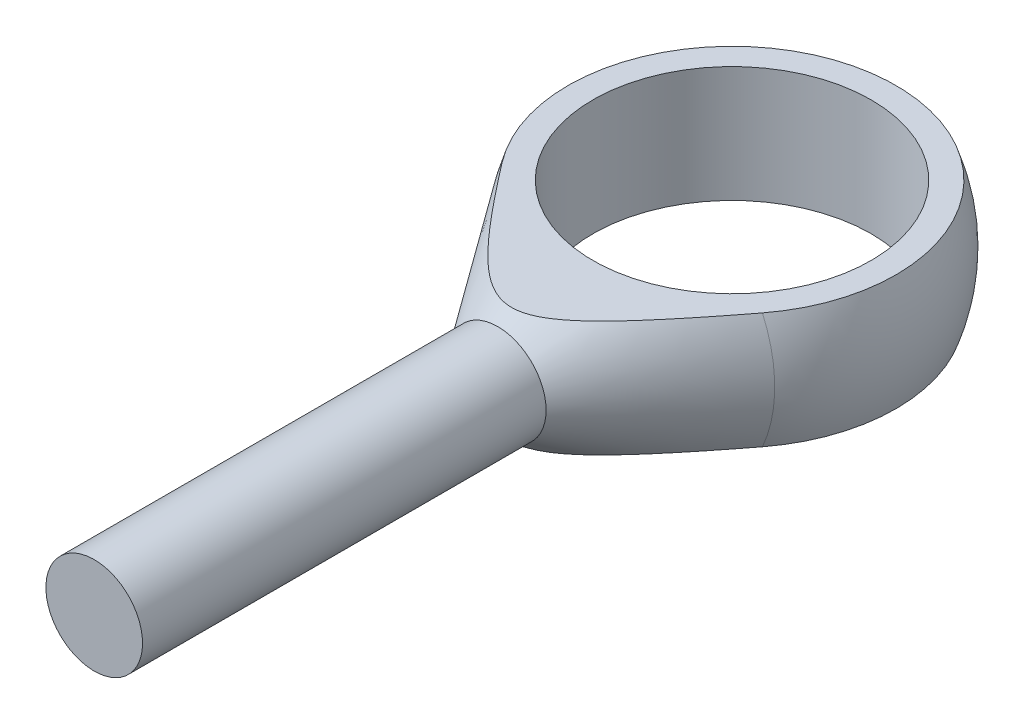
ISO-10303-21;
HEADER;
FILE_DESCRIPTION(('STEP AP214'),'2;1');
FILE_NAME('part.step','',(''),(''),'','','');
FILE_SCHEMA(('AUTOMOTIVE_DESIGN { 1 0 10303 214 1 1 1 1 }'));
ENDSEC;
DATA;
#1=APPLICATION_CONTEXT('core data for automotive mechanical design processes');
#2=APPLICATION_PROTOCOL_DEFINITION('international standard','automotive_design',2000,#1);
#3=PRODUCT_CONTEXT('',#1,'mechanical');
#4=PRODUCT('Part','Part','',(#3));
#5=PRODUCT_RELATED_PRODUCT_CATEGORY('part','',(#4));
#6=PRODUCT_DEFINITION_FORMATION('','',#4);
#7=PRODUCT_DEFINITION_CONTEXT('part definition',#1,'design');
#8=PRODUCT_DEFINITION('design','',#6,#7);
#9=PRODUCT_DEFINITION_SHAPE('','',#8);
#10=(LENGTH_UNIT() NAMED_UNIT(*) SI_UNIT(.MILLI.,.METRE.));
#11=(NAMED_UNIT(*) PLANE_ANGLE_UNIT() SI_UNIT($,.RADIAN.));
#12=(NAMED_UNIT(*) SI_UNIT($,.STERADIAN.) SOLID_ANGLE_UNIT());
#13=UNCERTAINTY_MEASURE_WITH_UNIT(LENGTH_MEASURE(1.E-05),#10,'distance_accuracy_value','');
#14=(GEOMETRIC_REPRESENTATION_CONTEXT(3) GLOBAL_UNCERTAINTY_ASSIGNED_CONTEXT((#13)) GLOBAL_UNIT_ASSIGNED_CONTEXT((#10,
#11,#12)) REPRESENTATION_CONTEXT('',''));
#15=CARTESIAN_POINT('',(0.,0.,0.));
#16=DIRECTION('',(0.,0.,1.));
#17=DIRECTION('',(1.,0.,0.));
#18=AXIS2_PLACEMENT_3D('',#15,#16,#17);
#19=CARTESIAN_POINT('',(0.,0.,0.));
#20=DIRECTION('',(0.,-1.,0.));
#21=DIRECTION('',(-1.,0.,0.));
#22=AXIS2_PLACEMENT_3D('',#19,#20,#21);
#23=SPHERICAL_SURFACE('',#22,9.);
#24=CARTESIAN_POINT('',(0.,3.,0.));
#25=DIRECTION('',(0.,-1.,0.));
#26=DIRECTION('',(0.,0.,-1.));
#27=AXIS2_PLACEMENT_3D('',#24,#25,#26);
#28=CIRCLE('',#27,8.48528137423857);
#29=CARTESIAN_POINT('',(-6.73437568039459,2.99999999999998,5.16218792715937));
#30=VERTEX_POINT('',#29);
#31=CARTESIAN_POINT('',(6.73437568039457,3.00000000000002,5.16218792715937));
#32=VERTEX_POINT('',#31);
#33=EDGE_CURVE('E58',#30,#32,#28,.T.);
#34=ORIENTED_EDGE('',*,*,#33,.T.);
#35=CARTESIAN_POINT('',(0.,0.,5.16218792715937));
#36=DIRECTION('',(0.,0.,-1.));
#37=DIRECTION('',(-1.,0.,0.));
#38=AXIS2_PLACEMENT_3D('',#35,#36,#37);
#39=CIRCLE('',#38,7.37236839860095);
#40=CARTESIAN_POINT('',(6.73437568039459,-2.99999999999998,5.16218792715937));
#41=VERTEX_POINT('',#40);
#42=EDGE_CURVE('E74',#32,#41,#39,.T.);
#43=ORIENTED_EDGE('',*,*,#42,.T.);
#44=CARTESIAN_POINT('',(0.,-3.,0.));
#45=DIRECTION('',(0.,-1.,0.));
#46=DIRECTION('',(0.,0.,-1.));
#47=AXIS2_PLACEMENT_3D('',#44,#45,#46);
#48=CIRCLE('',#47,8.48528137423857);
#49=CARTESIAN_POINT('',(-6.73437568039457,-3.00000000000002,5.16218792715937));
#50=VERTEX_POINT('',#49);
#51=EDGE_CURVE('E69',#50,#41,#48,.T.);
#52=ORIENTED_EDGE('',*,*,#51,.F.);
#53=EDGE_CURVE('E72',#50,#30,#39,.T.);
#54=ORIENTED_EDGE('',*,*,#53,.T.);
#55=EDGE_LOOP('',(#34,#43,#52,#54));
#56=FACE_BOUND('',#55,.T.);
#57=ADVANCED_FACE('F39',(#56),#23,.T.);
#58=CARTESIAN_POINT('',(-7.2,-3.,0.));
#59=DIRECTION('',(0.,1.,0.));
#60=DIRECTION('',(0.,0.,1.));
#61=AXIS2_PLACEMENT_3D('',#58,#59,#60);
#62=PLANE('',#61);
#63=CARTESIAN_POINT('',(18.3408361734717,-2.99999999999994,-10.8504965729031));
#64=CARTESIAN_POINT('',(17.8496953666628,-2.99999999999994,-10.158304125032));
#65=CARTESIAN_POINT('',(17.3582394375304,-2.99999999999994,-9.46633474897407));
#66=CARTESIAN_POINT('',(16.3744051269048,-2.99999999999994,-8.0829688508108));
#67=CARTESIAN_POINT('',(15.8820266748044,-2.99999999999994,-7.3915723789271));
#68=CARTESIAN_POINT('',(14.8943611292801,-2.99999999999995,-6.00710521762286));
#69=CARTESIAN_POINT('',(14.3990699431728,-2.99999999999995,-5.3140374469505));
#70=CARTESIAN_POINT('',(13.4069826200578,-2.99999999999995,-3.92905967868847));
#71=CARTESIAN_POINT('',(12.9101866016022,-2.99999999999996,-3.23714959623604));
#72=CARTESIAN_POINT('',(12.0848309166761,-2.99999999999996,-2.09141471926));
#73=CARTESIAN_POINT('',(11.7568826860212,-2.99999999999996,-1.63714955383807));
#74=CARTESIAN_POINT('',(11.0997953370015,-2.99999999999996,-0.729481526529152));
#75=CARTESIAN_POINT('',(10.7706562197244,-2.99999999999996,-0.276078663855275));
#76=CARTESIAN_POINT('',(10.1107447600538,-2.99999999999996,0.629722811027464));
#77=CARTESIAN_POINT('',(9.77997200525646,-2.99999999999997,1.08212112295249));
#78=CARTESIAN_POINT('',(9.11637520329296,-2.99999999999997,1.98539896257034));
#79=CARTESIAN_POINT('',(8.78355119633724,-2.99999999999997,2.43627851976883));
#80=CARTESIAN_POINT('',(8.1161522031276,-2.99999999999997,3.33448751664643));
#81=CARTESIAN_POINT('',(7.78158632111017,-2.99999999999997,3.78182371532488));
#82=CARTESIAN_POINT('',(7.1084400604982,-2.99999999999998,4.67353250223299));
#83=CARTESIAN_POINT('',(6.76985936622562,-2.99999999999998,5.11790485307009));
#84=CARTESIAN_POINT('',(6.25755917386607,-2.99999999999998,5.78087713429529));
#85=CARTESIAN_POINT('',(6.08609497474082,-2.99999999999998,6.00121894179376));
#86=CARTESIAN_POINT('',(5.74126694261255,-2.99999999999998,6.44040975091969));
#87=CARTESIAN_POINT('',(5.5679031309455,-2.99999999999998,6.65925876926909));
#88=CARTESIAN_POINT('',(5.21877706533775,-2.99999999999998,7.09498952327412));
#89=CARTESIAN_POINT('',(5.0430151361045,-2.99999999999998,7.31187151877469));
#90=CARTESIAN_POINT('',(4.68834152429886,-2.99999999999998,7.7430407185915));
#91=CARTESIAN_POINT('',(4.50942998376244,-2.99999999999998,7.95732803918628));
#92=CARTESIAN_POINT('',(4.26911739167486,-2.99999999999999,8.23939493538093));
#93=CARTESIAN_POINT('',(4.20960625784181,-2.99999999999999,8.30878604969739));
#94=CARTESIAN_POINT('',(4.09007560383522,-2.99999999999999,8.44712969375365));
#95=CARTESIAN_POINT('',(4.03005608047228,-2.99999999999999,8.5160822207372));
#96=CARTESIAN_POINT('',(3.84914339184583,-2.99999999999999,8.72221433728284));
#97=CARTESIAN_POINT('',(3.72740627554525,-2.99999999999999,8.85865648841562));
#98=CARTESIAN_POINT('',(3.48055556744023,-2.99999999999999,9.12961765402039));
#99=CARTESIAN_POINT('',(3.35542894986392,-2.99999999999999,9.26412483613365));
#100=CARTESIAN_POINT('',(3.10159711198437,-2.99999999999999,9.52968710634544));
#101=CARTESIAN_POINT('',(2.97289260740304,-2.99999999999999,9.66074287479596));
#102=CARTESIAN_POINT('',(2.71542360341994,-2.99999999999999,9.91362158788298));
#103=CARTESIAN_POINT('',(2.58681973143847,-2.99999999999999,10.0356071424581));
#104=CARTESIAN_POINT('',(2.32382986754002,-2.99999999999999,10.2734998512875));
#105=CARTESIAN_POINT('',(2.18943878741538,-2.99999999999999,10.3894014492556));
#106=CARTESIAN_POINT('',(1.91420118797999,-2.99999999999999,10.6112856680158));
#107=CARTESIAN_POINT('',(1.77340711928382,-2.99999999999999,10.7173327149079));
#108=CARTESIAN_POINT('',(1.48244491888888,-2.99999999999999,10.9155126535024));
#109=CARTESIAN_POINT('',(1.33229917814859,-3.,11.0076771017169));
#110=CARTESIAN_POINT('',(1.11478621695225,-3.,11.121063039446));
#111=CARTESIAN_POINT('',(1.05221883665336,-3.,11.151501792557));
#112=CARTESIAN_POINT('',(0.925205033640339,-3.,11.2082834384152));
#113=CARTESIAN_POINT('',(0.860757915306809,-3.,11.2346247914354));
#114=CARTESIAN_POINT('',(0.730293128741352,-3.,11.2823743182219));
#115=CARTESIAN_POINT('',(0.664281536403156,-3.,11.3037989390249));
#116=CARTESIAN_POINT('',(0.530687488679508,-3.,11.3410641659255));
#117=CARTESIAN_POINT('',(0.463105146508561,-3.,11.3569051731494));
#118=CARTESIAN_POINT('',(0.325826454633525,-3.,11.3824917991943));
#119=CARTESIAN_POINT('',(0.256113848719209,-3.,11.3921514542846));
#120=CARTESIAN_POINT('',(0.116074538359548,-3.,11.4045325674609));
#121=CARTESIAN_POINT('',(0.0457479058310169,-3.,11.4072548274232));
#122=CARTESIAN_POINT('',(-0.0949458205595684,-3.,11.4056113983568));
#123=CARTESIAN_POINT('',(-0.165312767512023,-3.,11.4012332165897));
#124=CARTESIAN_POINT('',(-0.305277921977597,-3.,11.3856055251109));
#125=CARTESIAN_POINT('',(-0.374875998538595,-3.,11.3743548627188));
#126=CARTESIAN_POINT('',(-0.520804237702084,-3.,11.3438561717914));
#127=CARTESIAN_POINT('',(-0.596969822226068,-3.,11.3238267403435));
#128=CARTESIAN_POINT('',(-0.747176407964006,-3.,11.276936685599));
#129=CARTESIAN_POINT('',(-0.821216285776014,-3.,11.2500725216067));
#130=CARTESIAN_POINT('',(-0.967069499237322,-3.,11.1905809102426));
#131=CARTESIAN_POINT('',(-1.03887867457237,-3.,11.1579433747816));
#132=CARTESIAN_POINT('',(-1.18013585332305,-3.,11.0879664093157));
#133=CARTESIAN_POINT('',(-1.24958405409333,-3.,11.050627373544));
#134=CARTESIAN_POINT('',(-1.41112036140978,-3.00000000000001,10.9578424324715));
#135=CARTESIAN_POINT('',(-1.50225870487227,-3.00000000000001,10.9007493518333));
#136=CARTESIAN_POINT('',(-1.68093684285748,-3.00000000000001,10.7811571723269));
#137=CARTESIAN_POINT('',(-1.76847472117177,-3.00000000000001,10.7186552483579));
#138=CARTESIAN_POINT('',(-1.94059475835379,-3.00000000000001,10.5894051099494));
#139=CARTESIAN_POINT('',(-2.02517105182977,-3.00000000000001,10.5226491343123));
#140=CARTESIAN_POINT('',(-2.19167985251268,-3.00000000000001,10.3859130808501));
#141=CARTESIAN_POINT('',(-2.27361198733039,-3.00000000000001,10.3159325522364));
#142=CARTESIAN_POINT('',(-2.43584604807881,-3.00000000000001,10.1728885170448));
#143=CARTESIAN_POINT('',(-2.51613073934952,-3.00000000000001,10.099805542985));
#144=CARTESIAN_POINT('',(-2.67476833257466,-3.00000000000001,9.95157355529744));
#145=CARTESIAN_POINT('',(-2.75312116538855,-3.00000000000001,9.87642446792735));
#146=CARTESIAN_POINT('',(-2.90808025588691,-3.00000000000001,9.72454789539904));
#147=CARTESIAN_POINT('',(-2.98468863084358,-3.00000000000001,9.64782256520879));
#148=CARTESIAN_POINT('',(-3.13649231317561,-3.00000000000001,9.49299541468063));
#149=CARTESIAN_POINT('',(-3.21168767165691,-3.00000000000001,9.41489364432452));
#150=CARTESIAN_POINT('',(-3.45558111649027,-3.00000000000001,9.15766239337677));
#151=CARTESIAN_POINT('',(-3.62178024495769,-3.00000000000001,8.97616294665082));
#152=CARTESIAN_POINT('',(-3.94967580622338,-3.00000000000001,8.60913089694175));
#153=CARTESIAN_POINT('',(-4.11137162227899,-3.00000000000001,8.4235977476659));
#154=CARTESIAN_POINT('',(-4.43142518656328,-3.00000000000002,8.04955221619529));
#155=CARTESIAN_POINT('',(-4.58978157368969,-3.00000000000002,7.86103867198956));
#156=CARTESIAN_POINT('',(-4.90387830965965,-3.00000000000002,7.48184107780178));
#157=CARTESIAN_POINT('',(-5.05961857770351,-3.00000000000002,7.29115696108492));
#158=CARTESIAN_POINT('',(-5.36929440882113,-3.00000000000002,6.9078119906199));
#159=CARTESIAN_POINT('',(-5.5232265759225,-3.00000000000002,6.71514839776191));
#160=CARTESIAN_POINT('',(-5.82943566648462,-3.00000000000002,6.32850920916978));
#161=CARTESIAN_POINT('',(-5.98171257391047,-3.00000000000002,6.13453360075532));
#162=CARTESIAN_POINT('',(-6.43646561025439,-3.00000000000002,5.55114684840522));
#163=CARTESIAN_POINT('',(-6.73694252684683,-3.00000000000002,5.16017790377202));
#164=CARTESIAN_POINT('',(-7.33295840808353,-3.00000000000003,4.37716949487784));
#165=CARTESIAN_POINT('',(-7.62851310088097,-3.00000000000003,3.98514195894165));
#166=CARTESIAN_POINT('',(-8.2170321201009,-3.00000000000003,3.19911207244249));
#167=CARTESIAN_POINT('',(-8.50999628881428,-3.00000000000003,2.80510960390409));
#168=CARTESIAN_POINT('',(-9.09373307394777,-3.00000000000003,2.01601787210606));
#169=CARTESIAN_POINT('',(-9.384507379181,-3.00000000000003,1.62092985669971));
#170=CARTESIAN_POINT('',(-9.96457854136935,-3.00000000000003,0.82967033536277));
#171=CARTESIAN_POINT('',(-10.2538753957912,-3.00000000000004,0.43349882757623));
#172=CARTESIAN_POINT('',(-10.8707002807484,-3.00000000000004,-0.413781171632223));
#173=CARTESIAN_POINT('',(-11.1980603570777,-3.00000000000004,-0.865011881303814));
#174=CARTESIAN_POINT('',(-11.8516302693239,-3.00000000000004,-1.76830861410294));
#175=CARTESIAN_POINT('',(-12.1778400993516,-3.00000000000004,-2.2203746414893));
#176=CARTESIAN_POINT('',(-13.1553137588347,-3.00000000000005,-3.5778118744112));
#177=CARTESIAN_POINT('',(-13.8052276801744,-3.00000000000005,-4.48415495867676));
#178=CARTESIAN_POINT('',(-15.1037749725347,-3.00000000000005,-6.29998894752358));
#179=CARTESIAN_POINT('',(-15.7524045318709,-3.00000000000006,-7.20948257485395));
#180=CARTESIAN_POINT('',(-16.7240226372889,-3.00000000000006,-8.57445198594485));
#181=CARTESIAN_POINT('',(-17.0476237053124,-3.00000000000006,-9.02949193634293));
#182=CARTESIAN_POINT('',(-17.6944768154627,-3.00000000000006,-9.93981923128047));
#183=CARTESIAN_POINT('',(-18.0177288579079,-3.00000000000006,-10.3951065755937));
#184=CARTESIAN_POINT('',(-18.3408361734716,-3.00000000000006,-10.8504965729031));
#185=B_SPLINE_CURVE_WITH_KNOTS('',3,(#63,#64,#65,#66,#67,#68,#69,#70,#71,#72,#73,#74,#75,#76,
#77,#78,#79,#80,#81,#82,#83,#84,#85,#86,#87,#88,#89,#90,#91,#92,#93,#94,#95,#96,#97,#98,#99,
#100,#101,#102,#103,#104,#105,#106,#107,#108,#109,#110,#111,#112,#113,#114,#115,#116,#117,#118,
#119,#120,#121,#122,#123,#124,#125,#126,#127,#128,#129,#130,#131,#132,#133,#134,#135,#136,#137,
#138,#139,#140,#141,#142,#143,#144,#145,#146,#147,#148,#149,#150,#151,#152,#153,#154,#155,#156,
#157,#158,#159,#160,#161,#162,#163,#164,#165,#166,#167,#168,#169,#170,#171,#172,#173,#174,#175,
#176,#177,#178,#179,#180,#181,#182,#183,#184),.UNSPECIFIED.,.F.,.F.,(4,2,2,2,2,2,2,2,2,2,2,2,2,
2,2,2,2,2,2,2,2,2,2,2,2,2,2,2,2,2,2,2,2,2,2,2,2,2,2,2,2,2,2,2,2,2,2,2,2,2,2,2,2,2,2,2,2,2,2,2,
4),(0.,2.54620304839511,5.09260966146757,7.64817210059546,10.203538190685,11.8843585748652,
13.5651774244979,15.246444818539,16.9276793590942,18.6034937513821,20.2794407956318,
21.1170216200283,21.9545930465517,22.7920521688657,23.6294736210876,23.9037165021729,
24.1779611050063,24.7264974310509,25.2775740550703,25.8285412237044,26.3601720882286,
26.8922803161484,27.4206206089614,27.9477411956251,28.1563607120305,28.3650584353659,
28.5730475200073,28.7810216596831,28.9918285971807,29.2026111669256,29.4137649965893,
29.6249542515586,29.8608416827388,30.0968515638129,30.3332779849157,30.5696845942183,
30.8920506508579,31.2145861111306,31.5377278639674,31.86091492951,32.1865708659254,
32.5122384405831,32.8374870473452,33.1627238677966,33.9008940862379,34.6391649071613,
35.3777310372224,36.1163199363525,36.8561256613144,37.5959385465782,39.0751880086817,
40.5480446989135,42.0209904465883,43.4926513080847,44.9643146920321,46.6367249045641,
48.3091436674435,51.6549720954198,55.0062518917388,56.6813669904899,58.3564805600206),.UNSPECIFIED.);
#186=EDGE_CURVE('E53',#41,#50,#185,.T.);
#187=ORIENTED_EDGE('',*,*,#186,.T.);
#188=ORIENTED_EDGE('',*,*,#51,.T.);
#189=EDGE_LOOP('',(#187,#188));
#190=FACE_BOUND('',#189,.T.);
#191=CARTESIAN_POINT('',(0.,-3.,0.));
#192=DIRECTION('',(0.,-1.,0.));
#193=DIRECTION('',(0.,0.,-1.));
#194=AXIS2_PLACEMENT_3D('',#191,#192,#193);
#195=CIRCLE('',#194,7.2);
#196=CARTESIAN_POINT('',(0.,-3.,-7.2));
#197=VERTEX_POINT('',#196);
#198=EDGE_CURVE('E79',#197,#197,#195,.T.);
#199=ORIENTED_EDGE('',*,*,#198,.F.);
#200=EDGE_LOOP('',(#199));
#201=FACE_BOUND('',#200,.T.);
#202=ADVANCED_FACE('F81',(#190,#201),#62,.F.);
#203=CARTESIAN_POINT('',(0.,-4.38771613082962,0.));
#204=DIRECTION('',(0.,-1.,0.));
#205=DIRECTION('',(0.,0.,-1.));
#206=AXIS2_PLACEMENT_3D('',#203,#204,#205);
#207=CYLINDRICAL_SURFACE('',#206,7.2);
#208=CARTESIAN_POINT('',(0.,3.,0.));
#209=DIRECTION('',(0.,-1.,0.));
#210=DIRECTION('',(0.,0.,-1.));
#211=AXIS2_PLACEMENT_3D('',#208,#209,#210);
#212=CIRCLE('',#211,7.2);
#213=CARTESIAN_POINT('',(0.,3.,-7.2));
#214=VERTEX_POINT('',#213);
#215=EDGE_CURVE('E96',#214,#214,#212,.T.);
#216=ORIENTED_EDGE('',*,*,#215,.F.);
#217=EDGE_LOOP('',(#216));
#218=FACE_BOUND('',#217,.T.);
#219=ORIENTED_EDGE('',*,*,#198,.T.);
#220=EDGE_LOOP('',(#219));
#221=FACE_BOUND('',#220,.T.);
#222=ADVANCED_FACE('F128',(#218,#221),#207,.F.);
#223=CARTESIAN_POINT('',(-8.48528137423857,3.,0.));
#224=DIRECTION('',(0.,-1.,0.));
#225=DIRECTION('',(0.,0.,-1.));
#226=AXIS2_PLACEMENT_3D('',#223,#224,#225);
#227=PLANE('',#226);
#228=CARTESIAN_POINT('',(-18.3408361734717,2.99999999999994,-10.8504965729031));
#229=CARTESIAN_POINT('',(-17.8496953666628,2.99999999999994,-10.158304125032));
#230=CARTESIAN_POINT('',(-17.3582394375304,2.99999999999994,-9.46633474897408));
#231=CARTESIAN_POINT('',(-16.3744051269048,2.99999999999994,-8.08296885081081));
#232=CARTESIAN_POINT('',(-15.8820266748044,2.99999999999994,-7.39157237892711));
#233=CARTESIAN_POINT('',(-14.8943611292801,2.99999999999995,-6.00710521762287));
#234=CARTESIAN_POINT('',(-14.3990699431729,2.99999999999995,-5.3140374469505));
#235=CARTESIAN_POINT('',(-13.4069826200578,2.99999999999995,-3.92905967868848));
#236=CARTESIAN_POINT('',(-12.9101866016022,2.99999999999996,-3.23714959623605));
#237=CARTESIAN_POINT('',(-12.0848309166761,2.99999999999996,-2.09141471926001));
#238=CARTESIAN_POINT('',(-11.7568826860212,2.99999999999996,-1.63714955383808));
#239=CARTESIAN_POINT('',(-11.0997953370015,2.99999999999996,-0.729481526529162));
#240=CARTESIAN_POINT('',(-10.7706562197244,2.99999999999996,-0.276078663855285));
#241=CARTESIAN_POINT('',(-10.1107447600538,2.99999999999996,0.629722811027455));
#242=CARTESIAN_POINT('',(-9.77997200525647,2.99999999999997,1.08212112295248));
#243=CARTESIAN_POINT('',(-9.11637520329297,2.99999999999997,1.98539896257033));
#244=CARTESIAN_POINT('',(-8.78355119633725,2.99999999999997,2.43627851976882));
#245=CARTESIAN_POINT('',(-8.1161522031276,2.99999999999997,3.33448751664643));
#246=CARTESIAN_POINT('',(-7.78158632111017,2.99999999999997,3.78182371532487));
#247=CARTESIAN_POINT('',(-7.1084400604982,2.99999999999998,4.67353250223299));
#248=CARTESIAN_POINT('',(-6.76985936622562,2.99999999999998,5.11790485307009));
#249=CARTESIAN_POINT('',(-6.25755917386608,2.99999999999998,5.78087713429528));
#250=CARTESIAN_POINT('',(-6.08609497474082,2.99999999999998,6.00121894179375));
#251=CARTESIAN_POINT('',(-5.74126694261255,2.99999999999998,6.44040975091969));
#252=CARTESIAN_POINT('',(-5.5679031309455,2.99999999999998,6.65925876926908));
#253=CARTESIAN_POINT('',(-5.21877706533775,2.99999999999998,7.09498952327412));
#254=CARTESIAN_POINT('',(-5.0430151361045,2.99999999999998,7.31187151877469));
#255=CARTESIAN_POINT('',(-4.68834152429886,2.99999999999998,7.7430407185915));
#256=CARTESIAN_POINT('',(-4.50942998376244,2.99999999999998,7.95732803918628));
#257=CARTESIAN_POINT('',(-4.26911739167486,2.99999999999998,8.23939493538093));
#258=CARTESIAN_POINT('',(-4.20960625784181,2.99999999999998,8.30878604969739));
#259=CARTESIAN_POINT('',(-4.09007560383522,2.99999999999999,8.44712969375365));
#260=CARTESIAN_POINT('',(-4.03005608047228,2.99999999999999,8.51608222073721));
#261=CARTESIAN_POINT('',(-3.84914339184583,2.99999999999999,8.72221433728284));
#262=CARTESIAN_POINT('',(-3.72740627554525,2.99999999999999,8.85865648841563));
#263=CARTESIAN_POINT('',(-3.48055556744023,2.99999999999999,9.12961765402039));
#264=CARTESIAN_POINT('',(-3.35542894986392,2.99999999999999,9.26412483613365));
#265=CARTESIAN_POINT('',(-3.10159711198437,2.99999999999999,9.52968710634544));
#266=CARTESIAN_POINT('',(-2.97289260740304,2.99999999999999,9.66074287479596));
#267=CARTESIAN_POINT('',(-2.71542360341994,2.99999999999999,9.91362158788298));
#268=CARTESIAN_POINT('',(-2.58681973143847,2.99999999999999,10.0356071424581));
#269=CARTESIAN_POINT('',(-2.32382986754002,2.99999999999999,10.2734998512875));
#270=CARTESIAN_POINT('',(-2.18943878741538,2.99999999999999,10.3894014492556));
#271=CARTESIAN_POINT('',(-1.91420118797999,2.99999999999999,10.6112856680158));
#272=CARTESIAN_POINT('',(-1.77340711928382,2.99999999999999,10.7173327149079));
#273=CARTESIAN_POINT('',(-1.48244491888888,2.99999999999999,10.9155126535024));
#274=CARTESIAN_POINT('',(-1.33229917814859,2.99999999999999,11.0076771017169));
#275=CARTESIAN_POINT('',(-1.11478621695224,3.,11.121063039446));
#276=CARTESIAN_POINT('',(-1.05221883665335,3.,11.151501792557));
#277=CARTESIAN_POINT('',(-0.925205033640336,3.,11.2082834384152));
#278=CARTESIAN_POINT('',(-0.860757915306806,3.,11.2346247914354));
#279=CARTESIAN_POINT('',(-0.730293128741349,3.,11.2823743182219));
#280=CARTESIAN_POINT('',(-0.664281536403153,3.,11.3037989390249));
#281=CARTESIAN_POINT('',(-0.530687488679505,3.,11.3410641659255));
#282=CARTESIAN_POINT('',(-0.463105146508558,3.,11.3569051731494));
#283=CARTESIAN_POINT('',(-0.32582645463352,3.,11.3824917991943));
#284=CARTESIAN_POINT('',(-0.256113848719203,3.,11.3921514542846));
#285=CARTESIAN_POINT('',(-0.116074538359541,3.,11.4045325674609));
#286=CARTESIAN_POINT('',(-0.0457479058310096,3.,11.4072548274232));
#287=CARTESIAN_POINT('',(0.0949458205595758,3.,11.4056113983568));
#288=CARTESIAN_POINT('',(0.16531276751203,3.,11.4012332165897));
#289=CARTESIAN_POINT('',(0.305277921977603,3.,11.3856055251109));
#290=CARTESIAN_POINT('',(0.374875998538601,3.,11.3743548627188));
#291=CARTESIAN_POINT('',(0.520804237702088,3.,11.3438561717914));
#292=CARTESIAN_POINT('',(0.596969822226073,3.,11.3238267403435));
#293=CARTESIAN_POINT('',(0.747176407964011,3.,11.276936685599));
#294=CARTESIAN_POINT('',(0.821216285776018,3.,11.2500725216067));
#295=CARTESIAN_POINT('',(0.967069499237326,3.,11.1905809102426));
#296=CARTESIAN_POINT('',(1.03887867457237,3.,11.1579433747816));
#297=CARTESIAN_POINT('',(1.18013585332306,3.,11.0879664093157));
#298=CARTESIAN_POINT('',(1.24958405409334,3.,11.050627373544));
#299=CARTESIAN_POINT('',(1.41112036140979,3.,10.9578424324715));
#300=CARTESIAN_POINT('',(1.50225870487227,3.,10.9007493518333));
#301=CARTESIAN_POINT('',(1.68093684285749,3.00000000000001,10.7811571723269));
#302=CARTESIAN_POINT('',(1.76847472117178,3.00000000000001,10.7186552483579));
#303=CARTESIAN_POINT('',(1.9405947583538,3.00000000000001,10.5894051099494));
#304=CARTESIAN_POINT('',(2.02517105182977,3.00000000000001,10.5226491343123));
#305=CARTESIAN_POINT('',(2.19167985251269,3.00000000000001,10.3859130808501));
#306=CARTESIAN_POINT('',(2.2736119873304,3.00000000000001,10.3159325522364));
#307=CARTESIAN_POINT('',(2.43584604807882,3.00000000000001,10.1728885170448));
#308=CARTESIAN_POINT('',(2.51613073934954,3.00000000000001,10.0998055429849));
#309=CARTESIAN_POINT('',(2.67476833257467,3.00000000000001,9.95157355529743));
#310=CARTESIAN_POINT('',(2.75312116538856,3.00000000000001,9.87642446792734));
#311=CARTESIAN_POINT('',(2.90808025588692,3.00000000000001,9.72454789539903));
#312=CARTESIAN_POINT('',(2.98468863084359,3.00000000000001,9.64782256520878));
#313=CARTESIAN_POINT('',(3.13649231317563,3.00000000000001,9.49299541468062));
#314=CARTESIAN_POINT('',(3.21168767165693,3.00000000000001,9.41489364432451));
#315=CARTESIAN_POINT('',(3.45558111649028,3.00000000000001,9.15766239337677));
#316=CARTESIAN_POINT('',(3.62178024495769,3.00000000000001,8.97616294665081));
#317=CARTESIAN_POINT('',(3.94967580622339,3.00000000000001,8.60913089694174));
#318=CARTESIAN_POINT('',(4.11137162227901,3.00000000000001,8.42359774766589));
#319=CARTESIAN_POINT('',(4.43142518656329,3.00000000000002,8.04955221619528));
#320=CARTESIAN_POINT('',(4.5897815736897,3.00000000000002,7.86103867198955));
#321=CARTESIAN_POINT('',(4.90387830965966,3.00000000000002,7.48184107780177));
#322=CARTESIAN_POINT('',(5.05961857770353,3.00000000000002,7.2911569610849));
#323=CARTESIAN_POINT('',(5.36929440882114,3.00000000000002,6.90781199061988));
#324=CARTESIAN_POINT('',(5.52322657592251,3.00000000000002,6.71514839776189));
#325=CARTESIAN_POINT('',(5.82943566648464,3.00000000000002,6.32850920916976));
#326=CARTESIAN_POINT('',(5.98171257391049,3.00000000000002,6.1345336007553));
#327=CARTESIAN_POINT('',(6.43646561025441,3.00000000000002,5.5511468484052));
#328=CARTESIAN_POINT('',(6.73694252684685,3.00000000000002,5.16017790377199));
#329=CARTESIAN_POINT('',(7.33295840808356,3.00000000000003,4.37716949487781));
#330=CARTESIAN_POINT('',(7.62851310088099,3.00000000000003,3.98514195894162));
#331=CARTESIAN_POINT('',(8.21703212010093,3.00000000000003,3.19911207244245));
#332=CARTESIAN_POINT('',(8.50999628881431,3.00000000000003,2.80510960390405));
#333=CARTESIAN_POINT('',(9.0937330739478,3.00000000000003,2.01601787210602));
#334=CARTESIAN_POINT('',(9.38450737918103,3.00000000000003,1.62092985669966));
#335=CARTESIAN_POINT('',(9.96457854136938,3.00000000000003,0.829670335362723));
#336=CARTESIAN_POINT('',(10.2538753957913,3.00000000000004,0.433498827576184));
#337=CARTESIAN_POINT('',(10.8707002807484,3.00000000000004,-0.413781171632267));
#338=CARTESIAN_POINT('',(11.1980603570777,3.00000000000004,-0.865011881303857));
#339=CARTESIAN_POINT('',(11.8516302693239,3.00000000000004,-1.76830861410298));
#340=CARTESIAN_POINT('',(12.1778400993516,3.00000000000004,-2.22037464148934));
#341=CARTESIAN_POINT('',(13.1553137588347,3.00000000000005,-3.57781187441123));
#342=CARTESIAN_POINT('',(13.8052276801744,3.00000000000005,-4.48415495867679));
#343=CARTESIAN_POINT('',(15.1037749725347,3.00000000000005,-6.2999889475236));
#344=CARTESIAN_POINT('',(15.7524045318709,3.00000000000006,-7.20948257485397));
#345=CARTESIAN_POINT('',(16.7240226372889,3.00000000000006,-8.57445198594486));
#346=CARTESIAN_POINT('',(17.0476237053124,3.00000000000006,-9.02949193634294));
#347=CARTESIAN_POINT('',(17.6944768154627,3.00000000000006,-9.93981923128047));
#348=CARTESIAN_POINT('',(18.0177288579079,3.00000000000006,-10.3951065755937));
#349=CARTESIAN_POINT('',(18.3408361734716,3.00000000000006,-10.8504965729031));
#350=B_SPLINE_CURVE_WITH_KNOTS('',3,(#228,#229,#230,#231,#232,#233,#234,#235,#236,#237,#238,
#239,#240,#241,#242,#243,#244,#245,#246,#247,#248,#249,#250,#251,#252,#253,#254,#255,#256,#257,
#258,#259,#260,#261,#262,#263,#264,#265,#266,#267,#268,#269,#270,#271,#272,#273,#274,#275,#276,
#277,#278,#279,#280,#281,#282,#283,#284,#285,#286,#287,#288,#289,#290,#291,#292,#293,#294,#295,
#296,#297,#298,#299,#300,#301,#302,#303,#304,#305,#306,#307,#308,#309,#310,#311,#312,#313,#314,
#315,#316,#317,#318,#319,#320,#321,#322,#323,#324,#325,#326,#327,#328,#329,#330,#331,#332,#333,
#334,#335,#336,#337,#338,#339,#340,#341,#342,#343,#344,#345,#346,#347,#348,#349),.UNSPECIFIED.,
.F.,.F.,(4,2,2,2,2,2,2,2,2,2,2,2,2,2,2,2,2,2,2,2,2,2,2,2,2,2,2,2,2,2,2,2,2,2,2,2,2,2,2,2,2,2,2,
2,2,2,2,2,2,2,2,2,2,2,2,2,2,2,2,2,4),(0.,2.5462030483951,5.09260966146756,7.64817210059545,
10.203538190685,11.8843585748652,13.5651774244979,15.246444818539,16.9276793590942,
18.6034937513821,20.2794407956318,21.1170216200283,21.9545930465517,22.7920521688657,
23.6294736210876,23.9037165021729,24.1779611050063,24.7264974310509,25.2775740550703,
25.8285412237044,26.3601720882286,26.8922803161484,27.4206206089614,27.9477411956252,
28.1563607120305,28.3650584353659,28.5730475200073,28.7810216596831,28.9918285971807,
29.2026111669256,29.4137649965893,29.6249542515586,29.8608416827388,30.0968515638129,
30.3332779849157,30.5696845942183,30.8920506508579,31.2145861111306,31.5377278639674,
31.86091492951,32.1865708659255,32.5122384405831,32.8374870473452,33.1627238677967,
33.9008940862379,34.6391649071614,35.3777310372224,36.1163199363525,36.8561256613145,
37.5959385465782,39.0751880086817,40.5480446989135,42.0209904465884,43.4926513080847,
44.9643146920321,46.6367249045641,48.3091436674435,51.6549720954198,55.0062518917389,
56.6813669904899,58.3564805600206),.UNSPECIFIED.);
#351=EDGE_CURVE('E11',#30,#32,#350,.T.);
#352=ORIENTED_EDGE('',*,*,#351,.T.);
#353=ORIENTED_EDGE('',*,*,#33,.F.);
#354=EDGE_LOOP('',(#352,#353));
#355=FACE_BOUND('',#354,.T.);
#356=ORIENTED_EDGE('',*,*,#215,.T.);
#357=EDGE_LOOP('',(#356));
#358=FACE_BOUND('',#357,.T.);
#359=ADVANCED_FACE('F116',(#355,#358),#227,.F.);
#360=CARTESIAN_POINT('',(0.,0.,5.16218792715937));
#361=DIRECTION('',(0.,0.,-1.));
#362=DIRECTION('',(-1.,0.,0.));
#363=AXIS2_PLACEMENT_3D('',#360,#361,#362);
#364=CONICAL_SURFACE('',#363,7.37236839860095,0.61086523819801);
#365=CARTESIAN_POINT('',(0.,0.,12.1206511437347));
#366=DIRECTION('',(0.,0.,-1.));
#367=DIRECTION('',(-1.,0.,0.));
#368=AXIS2_PLACEMENT_3D('',#365,#366,#367);
#369=CIRCLE('',#368,2.5);
#370=CARTESIAN_POINT('',(-2.5,0.,12.1206511437347));
#371=VERTEX_POINT('',#370);
#372=EDGE_CURVE('E78',#371,#371,#369,.T.);
#373=ORIENTED_EDGE('',*,*,#372,.T.);
#374=EDGE_LOOP('',(#373));
#375=FACE_BOUND('',#374,.T.);
#376=ORIENTED_EDGE('',*,*,#351,.F.);
#377=ORIENTED_EDGE('',*,*,#53,.F.);
#378=ORIENTED_EDGE('',*,*,#186,.F.);
#379=ORIENTED_EDGE('',*,*,#42,.F.);
#380=EDGE_LOOP('',(#376,#377,#378,#379));
#381=FACE_BOUND('',#380,.T.);
#382=ADVANCED_FACE('F85',(#375,#381),#364,.T.);
#383=CARTESIAN_POINT('',(0.,0.,33.));
#384=DIRECTION('',(0.,0.,1.));
#385=DIRECTION('',(1.,0.,0.));
#386=AXIS2_PLACEMENT_3D('',#383,#384,#385);
#387=PLANE('',#386);
#388=CARTESIAN_POINT('',(0.,0.,33.));
#389=DIRECTION('',(0.,0.,1.));
#390=DIRECTION('',(1.,0.,0.));
#391=AXIS2_PLACEMENT_3D('',#388,#389,#390);
#392=CIRCLE('',#391,2.5);
#393=CARTESIAN_POINT('',(2.5,0.,33.));
#394=VERTEX_POINT('',#393);
#395=EDGE_CURVE('E89',#394,#394,#392,.T.);
#396=ORIENTED_EDGE('',*,*,#395,.T.);
#397=EDGE_LOOP('',(#396));
#398=FACE_BOUND('',#397,.T.);
#399=ADVANCED_FACE('F115',(#398),#387,.T.);
#400=CARTESIAN_POINT('',(0.,0.,-9.001));
#401=DIRECTION('',(0.,0.,1.));
#402=DIRECTION('',(1.,0.,0.));
#403=AXIS2_PLACEMENT_3D('',#400,#401,#402);
#404=CYLINDRICAL_SURFACE('',#403,2.5);
#405=ORIENTED_EDGE('',*,*,#372,.F.);
#406=EDGE_LOOP('',(#405));
#407=FACE_BOUND('',#406,.T.);
#408=ORIENTED_EDGE('',*,*,#395,.F.);
#409=EDGE_LOOP('',(#408));
#410=FACE_BOUND('',#409,.T.);
#411=ADVANCED_FACE('F121',(#407,#410),#404,.T.);
#412=CLOSED_SHELL('',(#57,#202,#222,#359,#382,#399,#411));
#413=MANIFOLD_SOLID_BREP('B2',#412);
#414=ADVANCED_BREP_SHAPE_REPRESENTATION('',(#18,#413),#14);
#415=SHAPE_DEFINITION_REPRESENTATION(#9,#414);
ENDSEC;
END-ISO-10303-21;
